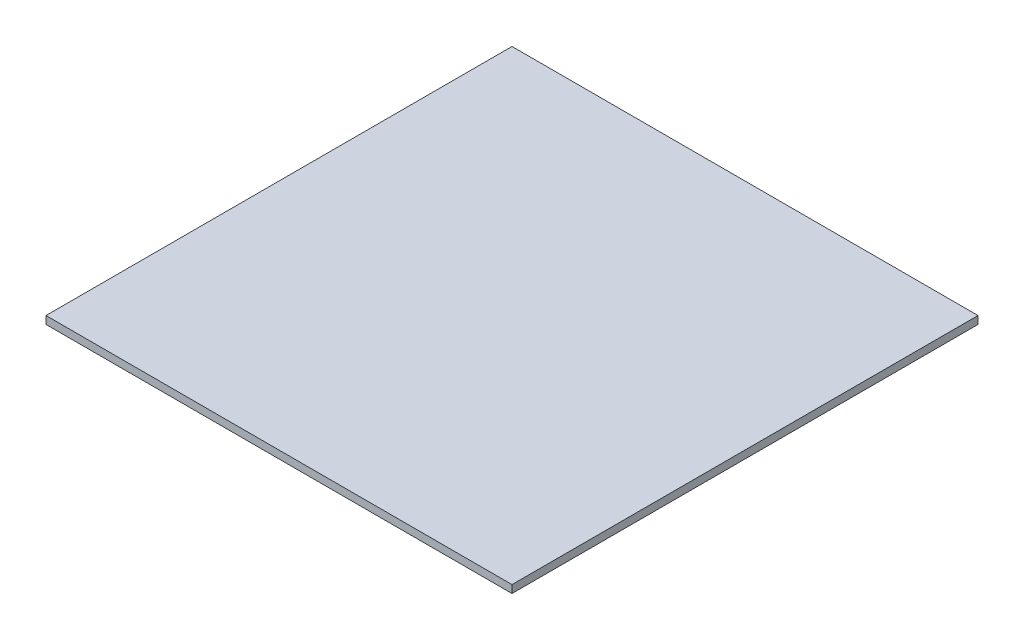
ISO-10303-21;
HEADER;
FILE_DESCRIPTION(('STEP AP214'),'2;1');
FILE_NAME('part.step','',(''),(''),'','','');
FILE_SCHEMA(('AUTOMOTIVE_DESIGN { 1 0 10303 214 1 1 1 1 }'));
ENDSEC;
DATA;
#1=APPLICATION_CONTEXT('core data for automotive mechanical design processes');
#2=APPLICATION_PROTOCOL_DEFINITION('international standard','automotive_design',2000,#1);
#3=PRODUCT_CONTEXT('',#1,'mechanical');
#4=PRODUCT('Part','Part','',(#3));
#5=PRODUCT_RELATED_PRODUCT_CATEGORY('part','',(#4));
#6=PRODUCT_DEFINITION_FORMATION('','',#4);
#7=PRODUCT_DEFINITION_CONTEXT('part definition',#1,'design');
#8=PRODUCT_DEFINITION('design','',#6,#7);
#9=PRODUCT_DEFINITION_SHAPE('','',#8);
#10=(LENGTH_UNIT() NAMED_UNIT(*) SI_UNIT(.MILLI.,.METRE.));
#11=(NAMED_UNIT(*) PLANE_ANGLE_UNIT() SI_UNIT($,.RADIAN.));
#12=(NAMED_UNIT(*) SI_UNIT($,.STERADIAN.) SOLID_ANGLE_UNIT());
#13=UNCERTAINTY_MEASURE_WITH_UNIT(LENGTH_MEASURE(1.E-05),#10,'distance_accuracy_value','');
#14=(GEOMETRIC_REPRESENTATION_CONTEXT(3) GLOBAL_UNCERTAINTY_ASSIGNED_CONTEXT((#13)) GLOBAL_UNIT_ASSIGNED_CONTEXT((#10,
#11,#12)) REPRESENTATION_CONTEXT('',''));
#15=CARTESIAN_POINT('',(0.,0.,0.));
#16=DIRECTION('',(0.,0.,1.));
#17=DIRECTION('',(1.,0.,0.));
#18=AXIS2_PLACEMENT_3D('',#15,#16,#17);
#19=CARTESIAN_POINT('',(0.,10.1599999999999,0.));
#20=DIRECTION('',(1.,0.,0.));
#21=DIRECTION('',(0.,0.,-1.));
#22=AXIS2_PLACEMENT_3D('',#19,#20,#21);
#23=PLANE('',#22);
#24=DIRECTION('',(0.,0.,1.));
#25=VECTOR('',#24,1.);
#26=CARTESIAN_POINT('',(0.,0.,0.));
#27=LINE('',#26,#25);
#28=CARTESIAN_POINT('',(-1.11022302462516E-13,0.,-609.6));
#29=VERTEX_POINT('',#28);
#30=CARTESIAN_POINT('',(0.,0.,0.));
#31=VERTEX_POINT('',#30);
#32=EDGE_CURVE('E97',#29,#31,#27,.T.);
#33=ORIENTED_EDGE('',*,*,#32,.T.);
#34=DIRECTION('',(0.,-1.,0.));
#35=VECTOR('',#34,1.);
#36=CARTESIAN_POINT('',(0.,10.1599999999999,0.));
#37=LINE('',#36,#35);
#38=CARTESIAN_POINT('',(0.,10.1599999999999,0.));
#39=VERTEX_POINT('',#38);
#40=EDGE_CURVE('E11',#39,#31,#37,.T.);
#41=ORIENTED_EDGE('',*,*,#40,.F.);
#42=DIRECTION('',(0.,0.,1.));
#43=VECTOR('',#42,1.);
#44=CARTESIAN_POINT('',(0.,10.1599999999999,0.));
#45=LINE('',#44,#43);
#46=CARTESIAN_POINT('',(-1.11022302462516E-13,10.1599999999999,-609.6));
#47=VERTEX_POINT('',#46);
#48=EDGE_CURVE('E85',#47,#39,#45,.T.);
#49=ORIENTED_EDGE('',*,*,#48,.F.);
#50=DIRECTION('',(0.,-1.,0.));
#51=VECTOR('',#50,1.);
#52=CARTESIAN_POINT('',(-1.11022302462516E-13,10.1599999999999,-609.6));
#53=LINE('',#52,#51);
#54=EDGE_CURVE('E93',#47,#29,#53,.T.);
#55=ORIENTED_EDGE('',*,*,#54,.T.);
#56=EDGE_LOOP('',(#33,#41,#49,#55));
#57=FACE_BOUND('',#56,.T.);
#58=ADVANCED_FACE('F34',(#57),#23,.F.);
#59=CARTESIAN_POINT('',(0.,10.1599999999999,0.));
#60=DIRECTION('',(0.,0.,-1.));
#61=DIRECTION('',(-1.,0.,0.));
#62=AXIS2_PLACEMENT_3D('',#59,#60,#61);
#63=PLANE('',#62);
#64=DIRECTION('',(1.,0.,0.));
#65=VECTOR('',#64,1.);
#66=CARTESIAN_POINT('',(0.,0.,0.));
#67=LINE('',#66,#65);
#68=CARTESIAN_POINT('',(609.6,0.,0.));
#69=VERTEX_POINT('',#68);
#70=EDGE_CURVE('E89',#31,#69,#67,.T.);
#71=ORIENTED_EDGE('',*,*,#70,.T.);
#72=DIRECTION('',(0.,-1.,0.));
#73=VECTOR('',#72,1.);
#74=CARTESIAN_POINT('',(609.6,10.1599999999999,0.));
#75=LINE('',#74,#73);
#76=CARTESIAN_POINT('',(609.6,10.1599999999999,0.));
#77=VERTEX_POINT('',#76);
#78=EDGE_CURVE('E42',#77,#69,#75,.T.);
#79=ORIENTED_EDGE('',*,*,#78,.F.);
#80=DIRECTION('',(1.,0.,0.));
#81=VECTOR('',#80,1.);
#82=CARTESIAN_POINT('',(0.,10.1599999999999,0.));
#83=LINE('',#82,#81);
#84=EDGE_CURVE('E80',#39,#77,#83,.T.);
#85=ORIENTED_EDGE('',*,*,#84,.F.);
#86=ORIENTED_EDGE('',*,*,#40,.T.);
#87=EDGE_LOOP('',(#71,#79,#85,#86));
#88=FACE_BOUND('',#87,.T.);
#89=ADVANCED_FACE('F88',(#88),#63,.F.);
#90=CARTESIAN_POINT('',(609.6,10.1599999999999,0.));
#91=DIRECTION('',(-1.,0.,0.));
#92=DIRECTION('',(0.,0.,1.));
#93=AXIS2_PLACEMENT_3D('',#90,#91,#92);
#94=PLANE('',#93);
#95=DIRECTION('',(0.,0.,-1.));
#96=VECTOR('',#95,1.);
#97=CARTESIAN_POINT('',(609.6,0.,0.));
#98=LINE('',#97,#96);
#99=CARTESIAN_POINT('',(609.6,0.,-609.6));
#100=VERTEX_POINT('',#99);
#101=EDGE_CURVE('E67',#69,#100,#98,.T.);
#102=ORIENTED_EDGE('',*,*,#101,.T.);
#103=DIRECTION('',(0.,-1.,0.));
#104=VECTOR('',#103,1.);
#105=CARTESIAN_POINT('',(609.6,10.1599999999999,-609.6));
#106=LINE('',#105,#104);
#107=CARTESIAN_POINT('',(609.6,10.1599999999999,-609.6));
#108=VERTEX_POINT('',#107);
#109=EDGE_CURVE('E90',#108,#100,#106,.T.);
#110=ORIENTED_EDGE('',*,*,#109,.F.);
#111=DIRECTION('',(0.,0.,-1.));
#112=VECTOR('',#111,1.);
#113=CARTESIAN_POINT('',(609.6,10.1599999999999,0.));
#114=LINE('',#113,#112);
#115=EDGE_CURVE('E83',#77,#108,#114,.T.);
#116=ORIENTED_EDGE('',*,*,#115,.F.);
#117=ORIENTED_EDGE('',*,*,#78,.T.);
#118=EDGE_LOOP('',(#102,#110,#116,#117));
#119=FACE_BOUND('',#118,.T.);
#120=ADVANCED_FACE('F91',(#119),#94,.F.);
#121=CARTESIAN_POINT('',(-1.11022302462516E-13,10.1599999999999,-609.6));
#122=DIRECTION('',(0.,0.,1.));
#123=DIRECTION('',(1.,0.,0.));
#124=AXIS2_PLACEMENT_3D('',#121,#122,#123);
#125=PLANE('',#124);
#126=DIRECTION('',(-1.,0.,0.));
#127=VECTOR('',#126,1.);
#128=CARTESIAN_POINT('',(-1.11022302462516E-13,0.,-609.6));
#129=LINE('',#128,#127);
#130=EDGE_CURVE('E73',#100,#29,#129,.T.);
#131=ORIENTED_EDGE('',*,*,#130,.T.);
#132=ORIENTED_EDGE('',*,*,#54,.F.);
#133=DIRECTION('',(-1.,0.,0.));
#134=VECTOR('',#133,1.);
#135=CARTESIAN_POINT('',(-1.11022302462516E-13,10.1599999999999,-609.6));
#136=LINE('',#135,#134);
#137=EDGE_CURVE('E50',#108,#47,#136,.T.);
#138=ORIENTED_EDGE('',*,*,#137,.F.);
#139=ORIENTED_EDGE('',*,*,#109,.T.);
#140=EDGE_LOOP('',(#131,#132,#138,#139));
#141=FACE_BOUND('',#140,.T.);
#142=ADVANCED_FACE('F104',(#141),#125,.F.);
#143=CARTESIAN_POINT('',(0.,10.1599999999999,0.));
#144=DIRECTION('',(0.,-1.,0.));
#145=DIRECTION('',(0.,0.,-1.));
#146=AXIS2_PLACEMENT_3D('',#143,#144,#145);
#147=PLANE('',#146);
#148=ORIENTED_EDGE('',*,*,#48,.T.);
#149=ORIENTED_EDGE('',*,*,#84,.T.);
#150=ORIENTED_EDGE('',*,*,#115,.T.);
#151=ORIENTED_EDGE('',*,*,#137,.T.);
#152=EDGE_LOOP('',(#148,#149,#150,#151));
#153=FACE_BOUND('',#152,.T.);
#154=ADVANCED_FACE('F81',(#153),#147,.F.);
#155=CARTESIAN_POINT('',(0.,0.,0.));
#156=DIRECTION('',(0.,-1.,0.));
#157=DIRECTION('',(0.,0.,-1.));
#158=AXIS2_PLACEMENT_3D('',#155,#156,#157);
#159=PLANE('',#158);
#160=ORIENTED_EDGE('',*,*,#32,.F.);
#161=ORIENTED_EDGE('',*,*,#130,.F.);
#162=ORIENTED_EDGE('',*,*,#101,.F.);
#163=ORIENTED_EDGE('',*,*,#70,.F.);
#164=EDGE_LOOP('',(#160,#161,#162,#163));
#165=FACE_BOUND('',#164,.T.);
#166=ADVANCED_FACE('F107',(#165),#159,.T.);
#167=CLOSED_SHELL('',(#58,#89,#120,#142,#154,#166));
#168=MANIFOLD_SOLID_BREP('B2',#167);
#169=ADVANCED_BREP_SHAPE_REPRESENTATION('',(#18,#168),#14);
#170=SHAPE_DEFINITION_REPRESENTATION(#9,#169);
ENDSEC;
END-ISO-10303-21;
